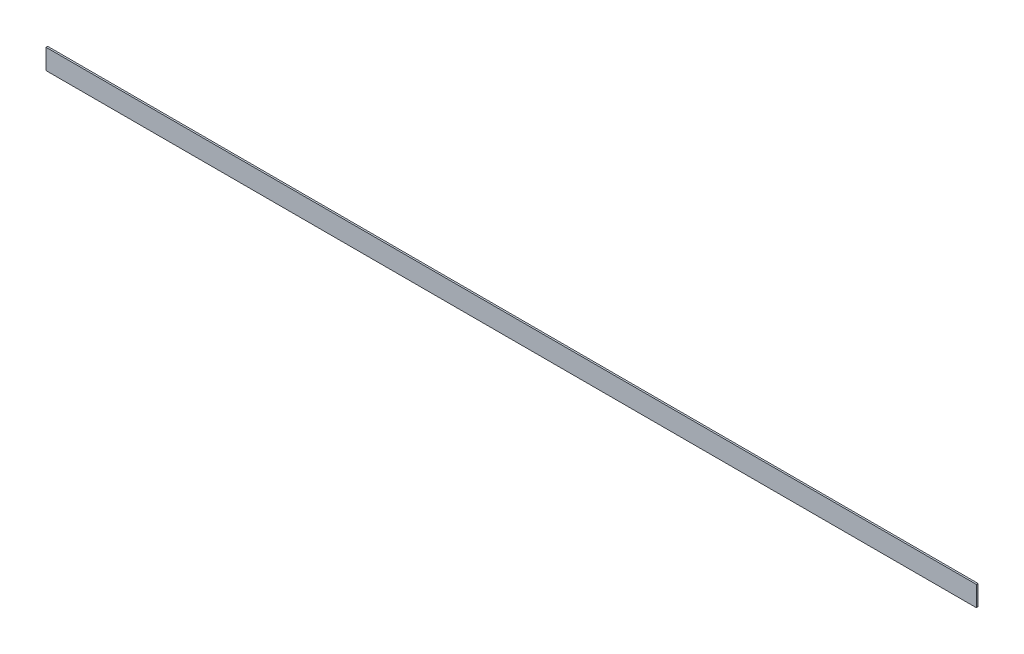
ISO-10303-21;
HEADER;
FILE_DESCRIPTION(('STEP AP214'),'2;1');
FILE_NAME('part.step','',(''),(''),'','','');
FILE_SCHEMA(('AUTOMOTIVE_DESIGN { 1 0 10303 214 1 1 1 1 }'));
ENDSEC;
DATA;
#1=APPLICATION_CONTEXT('core data for automotive mechanical design processes');
#2=APPLICATION_PROTOCOL_DEFINITION('international standard','automotive_design',2000,#1);
#3=PRODUCT_CONTEXT('',#1,'mechanical');
#4=PRODUCT('Part','Part','',(#3));
#5=PRODUCT_RELATED_PRODUCT_CATEGORY('part','',(#4));
#6=PRODUCT_DEFINITION_FORMATION('','',#4);
#7=PRODUCT_DEFINITION_CONTEXT('part definition',#1,'design');
#8=PRODUCT_DEFINITION('design','',#6,#7);
#9=PRODUCT_DEFINITION_SHAPE('','',#8);
#10=(LENGTH_UNIT() NAMED_UNIT(*) SI_UNIT(.MILLI.,.METRE.));
#11=(NAMED_UNIT(*) PLANE_ANGLE_UNIT() SI_UNIT($,.RADIAN.));
#12=(NAMED_UNIT(*) SI_UNIT($,.STERADIAN.) SOLID_ANGLE_UNIT());
#13=UNCERTAINTY_MEASURE_WITH_UNIT(LENGTH_MEASURE(1.E-05),#10,'distance_accuracy_value','');
#14=(GEOMETRIC_REPRESENTATION_CONTEXT(3) GLOBAL_UNCERTAINTY_ASSIGNED_CONTEXT((#13)) GLOBAL_UNIT_ASSIGNED_CONTEXT((#10,
#11,#12)) REPRESENTATION_CONTEXT('',''));
#15=CARTESIAN_POINT('',(0.,0.,0.));
#16=DIRECTION('',(0.,0.,1.));
#17=DIRECTION('',(1.,0.,0.));
#18=AXIS2_PLACEMENT_3D('',#15,#16,#17);
#19=CARTESIAN_POINT('',(3505.2,-38.1,-3.175));
#20=DIRECTION('',(0.,0.,1.));
#21=DIRECTION('',(1.,0.,0.));
#22=AXIS2_PLACEMENT_3D('',#19,#20,#21);
#23=PLANE('',#22);
#24=DIRECTION('',(0.,1.,0.));
#25=VECTOR('',#24,1.);
#26=CARTESIAN_POINT('',(0.,-38.1,-3.175));
#27=LINE('',#26,#25);
#28=CARTESIAN_POINT('',(0.,-38.1,-3.175));
#29=VERTEX_POINT('',#28);
#30=CARTESIAN_POINT('',(0.,38.1,-3.175));
#31=VERTEX_POINT('',#30);
#32=EDGE_CURVE('E98',#29,#31,#27,.T.);
#33=ORIENTED_EDGE('',*,*,#32,.T.);
#34=DIRECTION('',(-1.,0.,0.));
#35=VECTOR('',#34,1.);
#36=CARTESIAN_POINT('',(3505.2,38.1,-3.175));
#37=LINE('',#36,#35);
#38=CARTESIAN_POINT('',(3505.2,38.1,-3.175));
#39=VERTEX_POINT('',#38);
#40=EDGE_CURVE('E11',#39,#31,#37,.T.);
#41=ORIENTED_EDGE('',*,*,#40,.F.);
#42=DIRECTION('',(0.,1.,0.));
#43=VECTOR('',#42,1.);
#44=CARTESIAN_POINT('',(3505.2,-38.1,-3.175));
#45=LINE('',#44,#43);
#46=CARTESIAN_POINT('',(3505.2,-38.1,-3.175));
#47=VERTEX_POINT('',#46);
#48=EDGE_CURVE('E86',#47,#39,#45,.T.);
#49=ORIENTED_EDGE('',*,*,#48,.F.);
#50=DIRECTION('',(-1.,0.,0.));
#51=VECTOR('',#50,1.);
#52=CARTESIAN_POINT('',(3505.2,-38.1,-3.175));
#53=LINE('',#52,#51);
#54=EDGE_CURVE('E94',#47,#29,#53,.T.);
#55=ORIENTED_EDGE('',*,*,#54,.T.);
#56=EDGE_LOOP('',(#33,#41,#49,#55));
#57=FACE_BOUND('',#56,.T.);
#58=ADVANCED_FACE('F35',(#57),#23,.F.);
#59=CARTESIAN_POINT('',(3505.2,38.1,3.175));
#60=DIRECTION('',(0.,-1.,0.));
#61=DIRECTION('',(0.,0.,-1.));
#62=AXIS2_PLACEMENT_3D('',#59,#60,#61);
#63=PLANE('',#62);
#64=DIRECTION('',(0.,0.,1.));
#65=VECTOR('',#64,1.);
#66=CARTESIAN_POINT('',(0.,38.1,3.175));
#67=LINE('',#66,#65);
#68=CARTESIAN_POINT('',(0.,38.1,3.175));
#69=VERTEX_POINT('',#68);
#70=EDGE_CURVE('E90',#31,#69,#67,.T.);
#71=ORIENTED_EDGE('',*,*,#70,.T.);
#72=DIRECTION('',(-1.,0.,0.));
#73=VECTOR('',#72,1.);
#74=CARTESIAN_POINT('',(3505.2,38.1,3.175));
#75=LINE('',#74,#73);
#76=CARTESIAN_POINT('',(3505.2,38.1,3.175));
#77=VERTEX_POINT('',#76);
#78=EDGE_CURVE('E43',#77,#69,#75,.T.);
#79=ORIENTED_EDGE('',*,*,#78,.F.);
#80=DIRECTION('',(0.,0.,1.));
#81=VECTOR('',#80,1.);
#82=CARTESIAN_POINT('',(3505.2,38.1,3.175));
#83=LINE('',#82,#81);
#84=EDGE_CURVE('E81',#39,#77,#83,.T.);
#85=ORIENTED_EDGE('',*,*,#84,.F.);
#86=ORIENTED_EDGE('',*,*,#40,.T.);
#87=EDGE_LOOP('',(#71,#79,#85,#86));
#88=FACE_BOUND('',#87,.T.);
#89=ADVANCED_FACE('F89',(#88),#63,.F.);
#90=CARTESIAN_POINT('',(3505.2,-38.1,3.175));
#91=DIRECTION('',(0.,0.,-1.));
#92=DIRECTION('',(-1.,0.,0.));
#93=AXIS2_PLACEMENT_3D('',#90,#91,#92);
#94=PLANE('',#93);
#95=DIRECTION('',(0.,-1.,0.));
#96=VECTOR('',#95,1.);
#97=CARTESIAN_POINT('',(0.,-38.1,3.175));
#98=LINE('',#97,#96);
#99=CARTESIAN_POINT('',(0.,-38.1,3.175));
#100=VERTEX_POINT('',#99);
#101=EDGE_CURVE('E68',#69,#100,#98,.T.);
#102=ORIENTED_EDGE('',*,*,#101,.T.);
#103=DIRECTION('',(-1.,0.,0.));
#104=VECTOR('',#103,1.);
#105=CARTESIAN_POINT('',(3505.2,-38.1,3.175));
#106=LINE('',#105,#104);
#107=CARTESIAN_POINT('',(3505.2,-38.1,3.175));
#108=VERTEX_POINT('',#107);
#109=EDGE_CURVE('E91',#108,#100,#106,.T.);
#110=ORIENTED_EDGE('',*,*,#109,.F.);
#111=DIRECTION('',(0.,-1.,0.));
#112=VECTOR('',#111,1.);
#113=CARTESIAN_POINT('',(3505.2,-38.1,3.175));
#114=LINE('',#113,#112);
#115=EDGE_CURVE('E84',#77,#108,#114,.T.);
#116=ORIENTED_EDGE('',*,*,#115,.F.);
#117=ORIENTED_EDGE('',*,*,#78,.T.);
#118=EDGE_LOOP('',(#102,#110,#116,#117));
#119=FACE_BOUND('',#118,.T.);
#120=ADVANCED_FACE('F92',(#119),#94,.F.);
#121=CARTESIAN_POINT('',(3505.2,-38.1,3.175));
#122=DIRECTION('',(0.,1.,0.));
#123=DIRECTION('',(0.,0.,1.));
#124=AXIS2_PLACEMENT_3D('',#121,#122,#123);
#125=PLANE('',#124);
#126=DIRECTION('',(0.,0.,-1.));
#127=VECTOR('',#126,1.);
#128=CARTESIAN_POINT('',(0.,-38.1,3.175));
#129=LINE('',#128,#127);
#130=EDGE_CURVE('E74',#100,#29,#129,.T.);
#131=ORIENTED_EDGE('',*,*,#130,.T.);
#132=ORIENTED_EDGE('',*,*,#54,.F.);
#133=DIRECTION('',(0.,0.,-1.));
#134=VECTOR('',#133,1.);
#135=CARTESIAN_POINT('',(3505.2,-38.1,3.175));
#136=LINE('',#135,#134);
#137=EDGE_CURVE('E51',#108,#47,#136,.T.);
#138=ORIENTED_EDGE('',*,*,#137,.F.);
#139=ORIENTED_EDGE('',*,*,#109,.T.);
#140=EDGE_LOOP('',(#131,#132,#138,#139));
#141=FACE_BOUND('',#140,.T.);
#142=ADVANCED_FACE('F105',(#141),#125,.F.);
#143=CARTESIAN_POINT('',(3505.2,0.,0.));
#144=DIRECTION('',(-1.,0.,0.));
#145=DIRECTION('',(0.,0.,1.));
#146=AXIS2_PLACEMENT_3D('',#143,#144,#145);
#147=PLANE('',#146);
#148=ORIENTED_EDGE('',*,*,#48,.T.);
#149=ORIENTED_EDGE('',*,*,#84,.T.);
#150=ORIENTED_EDGE('',*,*,#115,.T.);
#151=ORIENTED_EDGE('',*,*,#137,.T.);
#152=EDGE_LOOP('',(#148,#149,#150,#151));
#153=FACE_BOUND('',#152,.T.);
#154=ADVANCED_FACE('F82',(#153),#147,.F.);
#155=CARTESIAN_POINT('',(0.,0.,0.));
#156=DIRECTION('',(-1.,0.,0.));
#157=DIRECTION('',(0.,0.,1.));
#158=AXIS2_PLACEMENT_3D('',#155,#156,#157);
#159=PLANE('',#158);
#160=ORIENTED_EDGE('',*,*,#32,.F.);
#161=ORIENTED_EDGE('',*,*,#130,.F.);
#162=ORIENTED_EDGE('',*,*,#101,.F.);
#163=ORIENTED_EDGE('',*,*,#70,.F.);
#164=EDGE_LOOP('',(#160,#161,#162,#163));
#165=FACE_BOUND('',#164,.T.);
#166=ADVANCED_FACE('F108',(#165),#159,.T.);
#167=CLOSED_SHELL('',(#58,#89,#120,#142,#154,#166));
#168=MANIFOLD_SOLID_BREP('B2',#167);
#169=ADVANCED_BREP_SHAPE_REPRESENTATION('',(#18,#168),#14);
#170=SHAPE_DEFINITION_REPRESENTATION(#9,#169);
ENDSEC;
END-ISO-10303-21;
